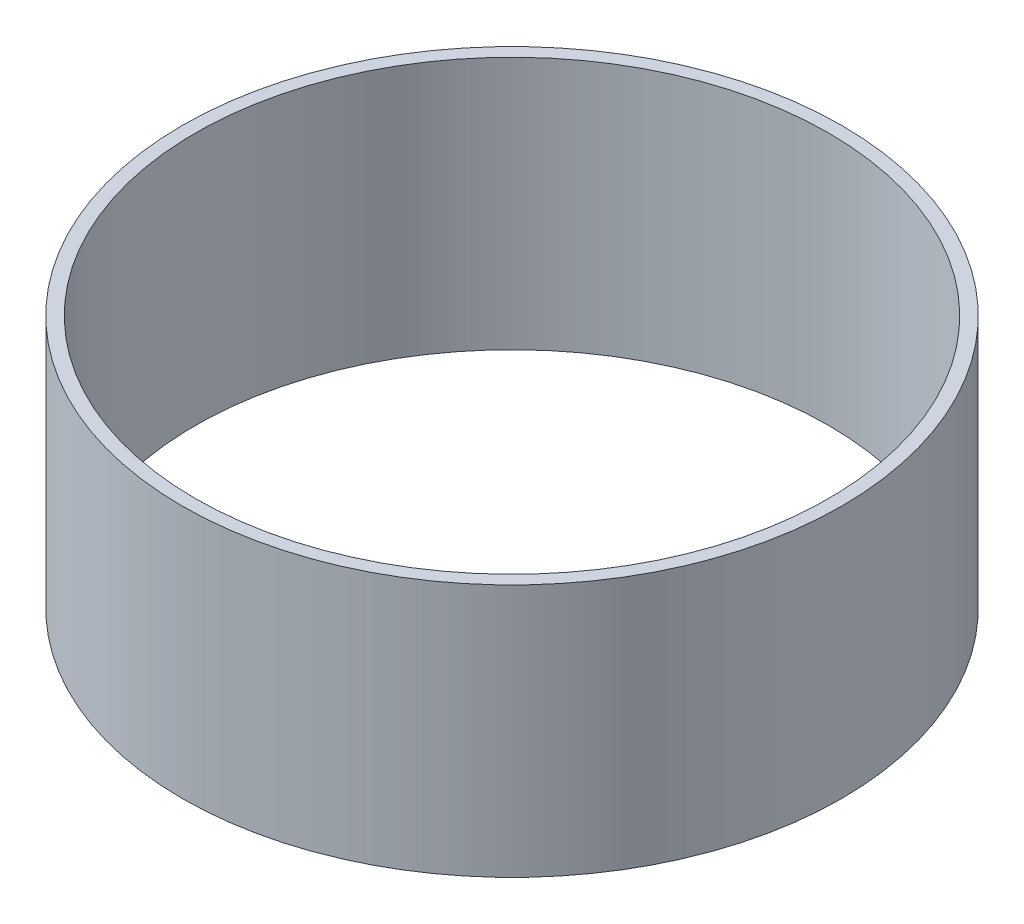
ISO-10303-21;
HEADER;
FILE_DESCRIPTION(('STEP AP214'),'2;1');
FILE_NAME('part.step','',(''),(''),'','','');
FILE_SCHEMA(('AUTOMOTIVE_DESIGN { 1 0 10303 214 1 1 1 1 }'));
ENDSEC;
DATA;
#1=APPLICATION_CONTEXT('core data for automotive mechanical design processes');
#2=APPLICATION_PROTOCOL_DEFINITION('international standard','automotive_design',2000,#1);
#3=PRODUCT_CONTEXT('',#1,'mechanical');
#4=PRODUCT('Part','Part','',(#3));
#5=PRODUCT_RELATED_PRODUCT_CATEGORY('part','',(#4));
#6=PRODUCT_DEFINITION_FORMATION('','',#4);
#7=PRODUCT_DEFINITION_CONTEXT('part definition',#1,'design');
#8=PRODUCT_DEFINITION('design','',#6,#7);
#9=PRODUCT_DEFINITION_SHAPE('','',#8);
#10=(LENGTH_UNIT() NAMED_UNIT(*) SI_UNIT(.MILLI.,.METRE.));
#11=(NAMED_UNIT(*) PLANE_ANGLE_UNIT() SI_UNIT($,.RADIAN.));
#12=(NAMED_UNIT(*) SI_UNIT($,.STERADIAN.) SOLID_ANGLE_UNIT());
#13=UNCERTAINTY_MEASURE_WITH_UNIT(LENGTH_MEASURE(1.E-05),#10,'distance_accuracy_value','');
#14=(GEOMETRIC_REPRESENTATION_CONTEXT(3) GLOBAL_UNCERTAINTY_ASSIGNED_CONTEXT((#13)) GLOBAL_UNIT_ASSIGNED_CONTEXT((#10,
#11,#12)) REPRESENTATION_CONTEXT('',''));
#15=CARTESIAN_POINT('',(0.,0.,0.));
#16=DIRECTION('',(0.,0.,1.));
#17=DIRECTION('',(1.,0.,0.));
#18=AXIS2_PLACEMENT_3D('',#15,#16,#17);
#19=CARTESIAN_POINT('',(0.,15.24,0.));
#20=DIRECTION('',(0.,1.,0.));
#21=DIRECTION('',(0.,0.,1.));
#22=AXIS2_PLACEMENT_3D('',#19,#20,#21);
#23=PLANE('',#22);
#24=CARTESIAN_POINT('',(0.,15.24,0.));
#25=DIRECTION('',(0.,1.,0.));
#26=DIRECTION('',(0.,0.,1.));
#27=AXIS2_PLACEMENT_3D('',#24,#25,#26);
#28=CIRCLE('',#27,39.6748);
#29=CARTESIAN_POINT('',(0.,15.24,39.6748));
#30=VERTEX_POINT('',#29);
#31=EDGE_CURVE('E10',#30,#30,#28,.T.);
#32=ORIENTED_EDGE('',*,*,#31,.T.);
#33=EDGE_LOOP('',(#32));
#34=FACE_BOUND('',#33,.T.);
#35=CARTESIAN_POINT('',(0.,15.24,0.));
#36=DIRECTION('',(0.,1.,0.));
#37=DIRECTION('',(0.,0.,1.));
#38=AXIS2_PLACEMENT_3D('',#35,#36,#37);
#39=CIRCLE('',#38,38.1);
#40=CARTESIAN_POINT('',(0.,15.24,38.1));
#41=VERTEX_POINT('',#40);
#42=EDGE_CURVE('E46',#41,#41,#39,.T.);
#43=ORIENTED_EDGE('',*,*,#42,.F.);
#44=EDGE_LOOP('',(#43));
#45=FACE_BOUND('',#44,.T.);
#46=ADVANCED_FACE('F35',(#34,#45),#23,.T.);
#47=CARTESIAN_POINT('',(0.,-15.24,0.));
#48=DIRECTION('',(0.,1.,0.));
#49=DIRECTION('',(0.,0.,1.));
#50=AXIS2_PLACEMENT_3D('',#47,#48,#49);
#51=PLANE('',#50);
#52=CARTESIAN_POINT('',(0.,-15.24,0.));
#53=DIRECTION('',(0.,1.,0.));
#54=DIRECTION('',(0.,0.,1.));
#55=AXIS2_PLACEMENT_3D('',#52,#53,#54);
#56=CIRCLE('',#55,39.6748);
#57=CARTESIAN_POINT('',(0.,-15.24,39.6748));
#58=VERTEX_POINT('',#57);
#59=EDGE_CURVE('E39',#58,#58,#56,.T.);
#60=ORIENTED_EDGE('',*,*,#59,.F.);
#61=EDGE_LOOP('',(#60));
#62=FACE_BOUND('',#61,.T.);
#63=CARTESIAN_POINT('',(0.,-15.24,0.));
#64=DIRECTION('',(0.,1.,0.));
#65=DIRECTION('',(0.,0.,1.));
#66=AXIS2_PLACEMENT_3D('',#63,#64,#65);
#67=CIRCLE('',#66,38.1);
#68=CARTESIAN_POINT('',(0.,-15.24,38.1));
#69=VERTEX_POINT('',#68);
#70=EDGE_CURVE('E48',#69,#69,#67,.T.);
#71=ORIENTED_EDGE('',*,*,#70,.T.);
#72=EDGE_LOOP('',(#71));
#73=FACE_BOUND('',#72,.T.);
#74=ADVANCED_FACE('F58',(#62,#73),#51,.F.);
#75=CARTESIAN_POINT('',(0.,15.24,0.));
#76=DIRECTION('',(0.,-1.,0.));
#77=DIRECTION('',(0.,0.,-1.));
#78=AXIS2_PLACEMENT_3D('',#75,#76,#77);
#79=CYLINDRICAL_SURFACE('',#78,39.6748);
#80=ORIENTED_EDGE('',*,*,#31,.F.);
#81=EDGE_LOOP('',(#80));
#82=FACE_BOUND('',#81,.T.);
#83=ORIENTED_EDGE('',*,*,#59,.T.);
#84=EDGE_LOOP('',(#83));
#85=FACE_BOUND('',#84,.T.);
#86=ADVANCED_FACE('F37',(#82,#85),#79,.T.);
#87=CARTESIAN_POINT('',(0.,15.24,0.));
#88=DIRECTION('',(0.,-1.,0.));
#89=DIRECTION('',(0.,0.,-1.));
#90=AXIS2_PLACEMENT_3D('',#87,#88,#89);
#91=CYLINDRICAL_SURFACE('',#90,38.1);
#92=ORIENTED_EDGE('',*,*,#42,.T.);
#93=EDGE_LOOP('',(#92));
#94=FACE_BOUND('',#93,.T.);
#95=ORIENTED_EDGE('',*,*,#70,.F.);
#96=EDGE_LOOP('',(#95));
#97=FACE_BOUND('',#96,.T.);
#98=ADVANCED_FACE('F54',(#94,#97),#91,.F.);
#99=CLOSED_SHELL('',(#46,#74,#86,#98));
#100=MANIFOLD_SOLID_BREP('B2',#99);
#101=ADVANCED_BREP_SHAPE_REPRESENTATION('',(#18,#100),#14);
#102=SHAPE_DEFINITION_REPRESENTATION(#9,#101);
ENDSEC;
END-ISO-10303-21;
